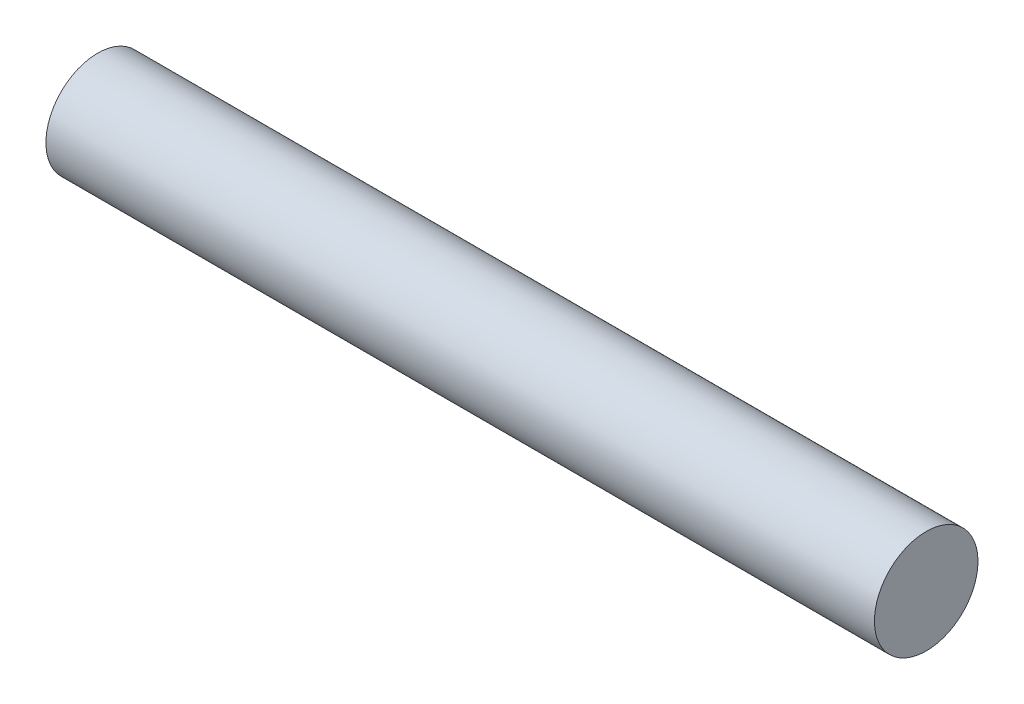
ISO-10303-21;
HEADER;
FILE_DESCRIPTION(('STEP AP214'),'2;1');
FILE_NAME('part.step','',(''),(''),'','','');
FILE_SCHEMA(('AUTOMOTIVE_DESIGN { 1 0 10303 214 1 1 1 1 }'));
ENDSEC;
DATA;
#1=APPLICATION_CONTEXT('core data for automotive mechanical design processes');
#2=APPLICATION_PROTOCOL_DEFINITION('international standard','automotive_design',2000,#1);
#3=PRODUCT_CONTEXT('',#1,'mechanical');
#4=PRODUCT('Part','Part','',(#3));
#5=PRODUCT_RELATED_PRODUCT_CATEGORY('part','',(#4));
#6=PRODUCT_DEFINITION_FORMATION('','',#4);
#7=PRODUCT_DEFINITION_CONTEXT('part definition',#1,'design');
#8=PRODUCT_DEFINITION('design','',#6,#7);
#9=PRODUCT_DEFINITION_SHAPE('','',#8);
#10=(LENGTH_UNIT() NAMED_UNIT(*) SI_UNIT(.MILLI.,.METRE.));
#11=(NAMED_UNIT(*) PLANE_ANGLE_UNIT() SI_UNIT($,.RADIAN.));
#12=(NAMED_UNIT(*) SI_UNIT($,.STERADIAN.) SOLID_ANGLE_UNIT());
#13=UNCERTAINTY_MEASURE_WITH_UNIT(LENGTH_MEASURE(1.E-05),#10,'distance_accuracy_value','');
#14=(GEOMETRIC_REPRESENTATION_CONTEXT(3) GLOBAL_UNCERTAINTY_ASSIGNED_CONTEXT((#13)) GLOBAL_UNIT_ASSIGNED_CONTEXT((#10,
#11,#12)) REPRESENTATION_CONTEXT('',''));
#15=CARTESIAN_POINT('',(0.,0.,0.));
#16=DIRECTION('',(0.,0.,1.));
#17=DIRECTION('',(1.,0.,0.));
#18=AXIS2_PLACEMENT_3D('',#15,#16,#17);
#19=CARTESIAN_POINT('',(400.,0.,0.));
#20=DIRECTION('',(-1.,0.,0.));
#21=DIRECTION('',(0.,0.,1.));
#22=AXIS2_PLACEMENT_3D('',#19,#20,#21);
#23=CYLINDRICAL_SURFACE('',#22,25.);
#24=CARTESIAN_POINT('',(400.,0.,0.));
#25=DIRECTION('',(1.,0.,0.));
#26=DIRECTION('',(0.,0.,-1.));
#27=AXIS2_PLACEMENT_3D('',#24,#25,#26);
#28=CIRCLE('',#27,25.);
#29=CARTESIAN_POINT('',(400.,0.,-25.));
#30=VERTEX_POINT('',#29);
#31=EDGE_CURVE('E10',#30,#30,#28,.T.);
#32=ORIENTED_EDGE('',*,*,#31,.F.);
#33=EDGE_LOOP('',(#32));
#34=FACE_BOUND('',#33,.T.);
#35=CARTESIAN_POINT('',(0.,0.,0.));
#36=DIRECTION('',(1.,0.,0.));
#37=DIRECTION('',(0.,0.,-1.));
#38=AXIS2_PLACEMENT_3D('',#35,#36,#37);
#39=CIRCLE('',#38,25.);
#40=CARTESIAN_POINT('',(0.,0.,-25.));
#41=VERTEX_POINT('',#40);
#42=EDGE_CURVE('E40',#41,#41,#39,.T.);
#43=ORIENTED_EDGE('',*,*,#42,.T.);
#44=EDGE_LOOP('',(#43));
#45=FACE_BOUND('',#44,.T.);
#46=ADVANCED_FACE('F37',(#34,#45),#23,.T.);
#47=CARTESIAN_POINT('',(400.,0.,0.));
#48=DIRECTION('',(1.,0.,0.));
#49=DIRECTION('',(0.,0.,-1.));
#50=AXIS2_PLACEMENT_3D('',#47,#48,#49);
#51=PLANE('',#50);
#52=ORIENTED_EDGE('',*,*,#31,.T.);
#53=EDGE_LOOP('',(#52));
#54=FACE_BOUND('',#53,.T.);
#55=ADVANCED_FACE('F54',(#54),#51,.T.);
#56=CARTESIAN_POINT('',(0.,0.,0.));
#57=DIRECTION('',(1.,0.,0.));
#58=DIRECTION('',(0.,0.,-1.));
#59=AXIS2_PLACEMENT_3D('',#56,#57,#58);
#60=PLANE('',#59);
#61=ORIENTED_EDGE('',*,*,#42,.F.);
#62=EDGE_LOOP('',(#61));
#63=FACE_BOUND('',#62,.T.);
#64=ADVANCED_FACE('F52',(#63),#60,.F.);
#65=CLOSED_SHELL('',(#46,#55,#64));
#66=MANIFOLD_SOLID_BREP('B2',#65);
#67=ADVANCED_BREP_SHAPE_REPRESENTATION('',(#18,#66),#14);
#68=SHAPE_DEFINITION_REPRESENTATION(#9,#67);
ENDSEC;
END-ISO-10303-21;
